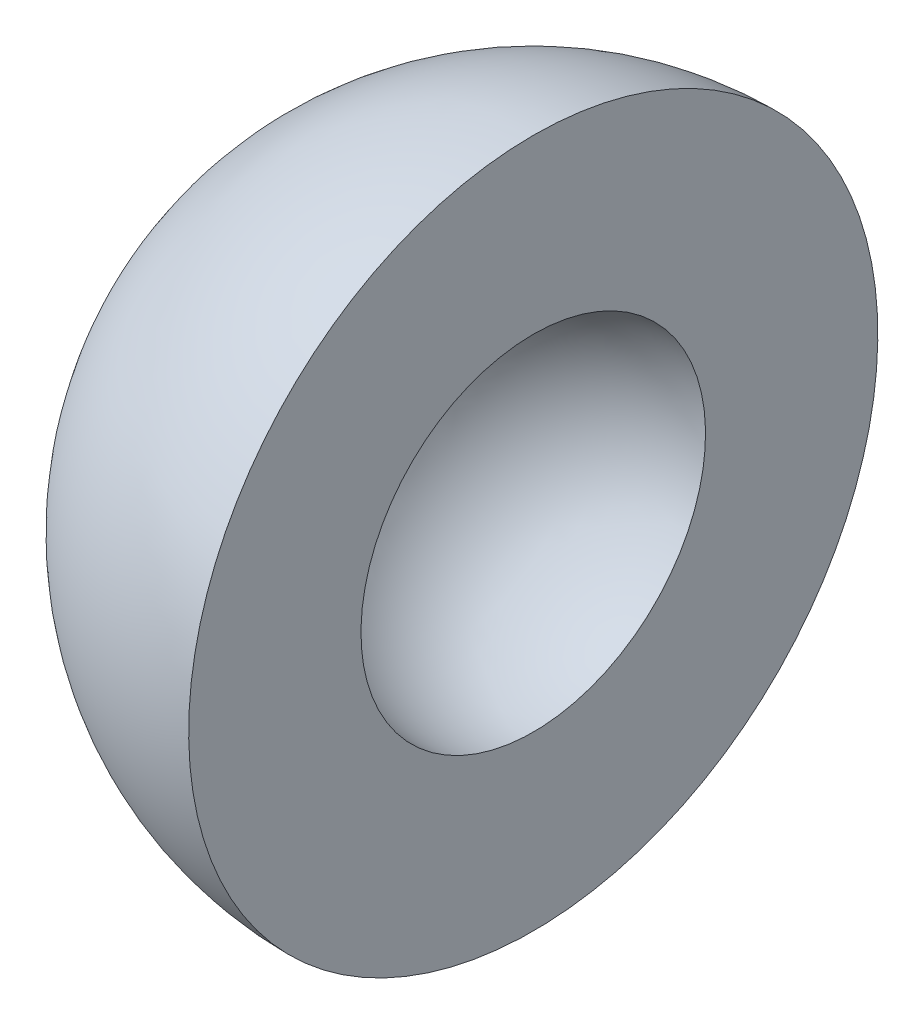
ISO-10303-21;
HEADER;
FILE_DESCRIPTION(('STEP AP214'),'2;1');
FILE_NAME('part.step','',(''),(''),'','','');
FILE_SCHEMA(('AUTOMOTIVE_DESIGN { 1 0 10303 214 1 1 1 1 }'));
ENDSEC;
DATA;
#1=APPLICATION_CONTEXT('core data for automotive mechanical design processes');
#2=APPLICATION_PROTOCOL_DEFINITION('international standard','automotive_design',2000,#1);
#3=PRODUCT_CONTEXT('',#1,'mechanical');
#4=PRODUCT('Part','Part','',(#3));
#5=PRODUCT_RELATED_PRODUCT_CATEGORY('part','',(#4));
#6=PRODUCT_DEFINITION_FORMATION('','',#4);
#7=PRODUCT_DEFINITION_CONTEXT('part definition',#1,'design');
#8=PRODUCT_DEFINITION('design','',#6,#7);
#9=PRODUCT_DEFINITION_SHAPE('','',#8);
#10=(LENGTH_UNIT() NAMED_UNIT(*) SI_UNIT(.MILLI.,.METRE.));
#11=(NAMED_UNIT(*) PLANE_ANGLE_UNIT() SI_UNIT($,.RADIAN.));
#12=(NAMED_UNIT(*) SI_UNIT($,.STERADIAN.) SOLID_ANGLE_UNIT());
#13=UNCERTAINTY_MEASURE_WITH_UNIT(LENGTH_MEASURE(1.E-05),#10,'distance_accuracy_value','');
#14=(GEOMETRIC_REPRESENTATION_CONTEXT(3) GLOBAL_UNCERTAINTY_ASSIGNED_CONTEXT((#13)) GLOBAL_UNIT_ASSIGNED_CONTEXT((#10,
#11,#12)) REPRESENTATION_CONTEXT('',''));
#15=CARTESIAN_POINT('',(0.,0.,0.));
#16=DIRECTION('',(0.,0.,1.));
#17=DIRECTION('',(1.,0.,0.));
#18=AXIS2_PLACEMENT_3D('',#15,#16,#17);
#19=CARTESIAN_POINT('',(0.,0.,0.));
#20=DIRECTION('',(1.,0.,0.));
#21=DIRECTION('',(0.,1.,0.));
#22=AXIS2_PLACEMENT_3D('',#19,#20,#21);
#23=SPHERICAL_SURFACE('',#22,30.);
#24=CARTESIAN_POINT('',(0.,0.,0.));
#25=DIRECTION('',(1.,0.,0.));
#26=DIRECTION('',(0.,1.,0.));
#27=AXIS2_PLACEMENT_3D('',#24,#25,#26);
#28=CIRCLE('',#27,30.);
#29=CARTESIAN_POINT('',(0.,30.,0.));
#30=VERTEX_POINT('',#29);
#31=EDGE_CURVE('E10',#30,#30,#28,.T.);
#32=ORIENTED_EDGE('',*,*,#31,.F.);
#33=EDGE_LOOP('',(#32));
#34=FACE_BOUND('',#33,.T.);
#35=ADVANCED_FACE('F41',(#34),#23,.T.);
#36=CARTESIAN_POINT('',(0.,30.,0.));
#37=DIRECTION('',(1.,0.,0.));
#38=DIRECTION('',(0.,1.,0.));
#39=AXIS2_PLACEMENT_3D('',#36,#37,#38);
#40=PLANE('',#39);
#41=ORIENTED_EDGE('',*,*,#31,.T.);
#42=EDGE_LOOP('',(#41));
#43=FACE_BOUND('',#42,.T.);
#44=CARTESIAN_POINT('',(0.,0.,0.));
#45=DIRECTION('',(1.,0.,0.));
#46=DIRECTION('',(0.,1.,0.));
#47=AXIS2_PLACEMENT_3D('',#44,#45,#46);
#48=CIRCLE('',#47,15.);
#49=CARTESIAN_POINT('',(0.,15.,0.));
#50=VERTEX_POINT('',#49);
#51=EDGE_CURVE('E47',#50,#50,#48,.T.);
#52=ORIENTED_EDGE('',*,*,#51,.F.);
#53=EDGE_LOOP('',(#52));
#54=FACE_BOUND('',#53,.T.);
#55=ADVANCED_FACE('F55',(#43,#54),#40,.T.);
#56=CARTESIAN_POINT('',(0.,0.,0.));
#57=DIRECTION('',(1.,0.,0.));
#58=DIRECTION('',(0.,1.,0.));
#59=AXIS2_PLACEMENT_3D('',#56,#57,#58);
#60=SPHERICAL_SURFACE('',#59,15.);
#61=ORIENTED_EDGE('',*,*,#51,.T.);
#62=EDGE_LOOP('',(#61));
#63=FACE_BOUND('',#62,.T.);
#64=ADVANCED_FACE('F53',(#63),#60,.F.);
#65=CLOSED_SHELL('',(#35,#55,#64));
#66=MANIFOLD_SOLID_BREP('B2',#65);
#67=ADVANCED_BREP_SHAPE_REPRESENTATION('',(#18,#66),#14);
#68=SHAPE_DEFINITION_REPRESENTATION(#9,#67);
ENDSEC;
END-ISO-10303-21;
